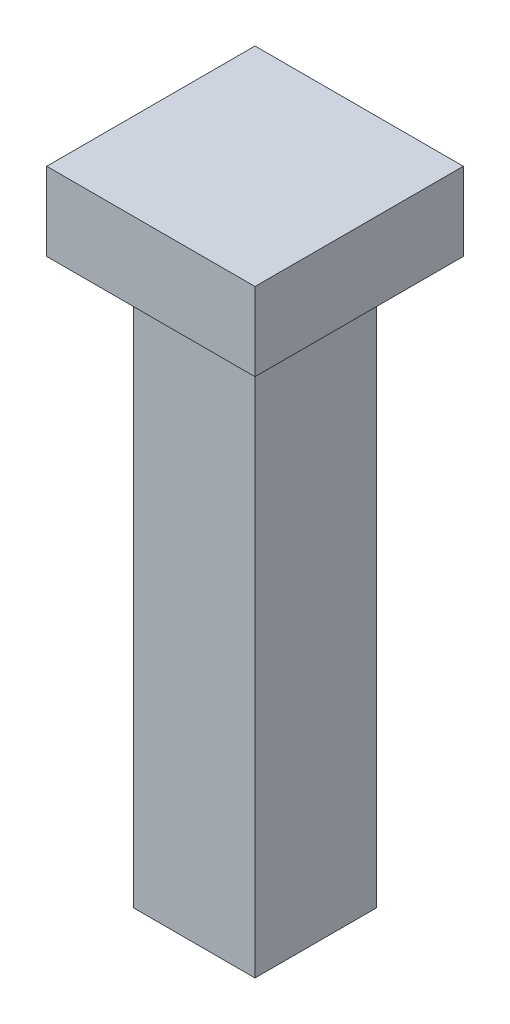
ISO-10303-21;
HEADER;
FILE_DESCRIPTION(('STEP AP214'),'2;1');
FILE_NAME('part.step','',(''),(''),'','','');
FILE_SCHEMA(('AUTOMOTIVE_DESIGN { 1 0 10303 214 1 1 1 1 }'));
ENDSEC;
DATA;
#1=APPLICATION_CONTEXT('core data for automotive mechanical design processes');
#2=APPLICATION_PROTOCOL_DEFINITION('international standard','automotive_design',2000,#1);
#3=PRODUCT_CONTEXT('',#1,'mechanical');
#4=PRODUCT('Part','Part','',(#3));
#5=PRODUCT_RELATED_PRODUCT_CATEGORY('part','',(#4));
#6=PRODUCT_DEFINITION_FORMATION('','',#4);
#7=PRODUCT_DEFINITION_CONTEXT('part definition',#1,'design');
#8=PRODUCT_DEFINITION('design','',#6,#7);
#9=PRODUCT_DEFINITION_SHAPE('','',#8);
#10=(LENGTH_UNIT() NAMED_UNIT(*) SI_UNIT(.MILLI.,.METRE.));
#11=(NAMED_UNIT(*) PLANE_ANGLE_UNIT() SI_UNIT($,.RADIAN.));
#12=(NAMED_UNIT(*) SI_UNIT($,.STERADIAN.) SOLID_ANGLE_UNIT());
#13=UNCERTAINTY_MEASURE_WITH_UNIT(LENGTH_MEASURE(1.E-05),#10,'distance_accuracy_value','');
#14=(GEOMETRIC_REPRESENTATION_CONTEXT(3) GLOBAL_UNCERTAINTY_ASSIGNED_CONTEXT((#13)) GLOBAL_UNIT_ASSIGNED_CONTEXT((#10,
#11,#12)) REPRESENTATION_CONTEXT('',''));
#15=CARTESIAN_POINT('',(0.,0.,0.));
#16=DIRECTION('',(0.,0.,1.));
#17=DIRECTION('',(1.,0.,0.));
#18=AXIS2_PLACEMENT_3D('',#15,#16,#17);
#19=CARTESIAN_POINT('',(0.,16.51,0.));
#20=DIRECTION('',(1.,0.,0.));
#21=DIRECTION('',(0.,0.,-1.));
#22=AXIS2_PLACEMENT_3D('',#19,#20,#21);
#23=PLANE('',#22);
#24=DIRECTION('',(0.,0.,1.));
#25=VECTOR('',#24,1.);
#26=CARTESIAN_POINT('',(0.,0.,0.));
#27=LINE('',#26,#25);
#28=CARTESIAN_POINT('',(0.,0.,0.));
#29=VERTEX_POINT('',#28);
#30=CARTESIAN_POINT('',(0.,0.,3.556));
#31=VERTEX_POINT('',#30);
#32=EDGE_CURVE('E131',#29,#31,#27,.T.);
#33=ORIENTED_EDGE('',*,*,#32,.T.);
#34=DIRECTION('',(0.,-1.,0.));
#35=VECTOR('',#34,1.);
#36=CARTESIAN_POINT('',(0.,16.51,3.556));
#37=LINE('',#36,#35);
#38=CARTESIAN_POINT('',(0.,16.51,3.556));
#39=VERTEX_POINT('',#38);
#40=EDGE_CURVE('E11',#39,#31,#37,.T.);
#41=ORIENTED_EDGE('',*,*,#40,.F.);
#42=DIRECTION('',(0.,0.,1.));
#43=VECTOR('',#42,1.);
#44=CARTESIAN_POINT('',(0.,16.51,0.));
#45=LINE('',#44,#43);
#46=CARTESIAN_POINT('',(0.,16.51,0.));
#47=VERTEX_POINT('',#46);
#48=EDGE_CURVE('E140',#47,#39,#45,.T.);
#49=ORIENTED_EDGE('',*,*,#48,.F.);
#50=DIRECTION('',(0.,-1.,0.));
#51=VECTOR('',#50,1.);
#52=CARTESIAN_POINT('',(0.,16.51,0.));
#53=LINE('',#52,#51);
#54=EDGE_CURVE('E149',#47,#29,#53,.T.);
#55=ORIENTED_EDGE('',*,*,#54,.T.);
#56=EDGE_LOOP('',(#33,#41,#49,#55));
#57=FACE_BOUND('',#56,.T.);
#58=ADVANCED_FACE('F33',(#57),#23,.F.);
#59=CARTESIAN_POINT('',(0.,16.51,3.556));
#60=DIRECTION('',(0.,0.,-1.));
#61=DIRECTION('',(-1.,0.,0.));
#62=AXIS2_PLACEMENT_3D('',#59,#60,#61);
#63=PLANE('',#62);
#64=DIRECTION('',(1.,0.,0.));
#65=VECTOR('',#64,1.);
#66=CARTESIAN_POINT('',(0.,0.,3.556));
#67=LINE('',#66,#65);
#68=CARTESIAN_POINT('',(3.556,0.,3.556));
#69=VERTEX_POINT('',#68);
#70=EDGE_CURVE('E134',#31,#69,#67,.T.);
#71=ORIENTED_EDGE('',*,*,#70,.T.);
#72=DIRECTION('',(0.,-1.,0.));
#73=VECTOR('',#72,1.);
#74=CARTESIAN_POINT('',(3.556,16.51,3.556));
#75=LINE('',#74,#73);
#76=CARTESIAN_POINT('',(3.556,16.51,3.556));
#77=VERTEX_POINT('',#76);
#78=EDGE_CURVE('E41',#77,#69,#75,.T.);
#79=ORIENTED_EDGE('',*,*,#78,.F.);
#80=DIRECTION('',(1.,0.,0.));
#81=VECTOR('',#80,1.);
#82=CARTESIAN_POINT('',(0.,16.51,3.556));
#83=LINE('',#82,#81);
#84=EDGE_CURVE('E75',#39,#77,#83,.T.);
#85=ORIENTED_EDGE('',*,*,#84,.F.);
#86=ORIENTED_EDGE('',*,*,#40,.T.);
#87=EDGE_LOOP('',(#71,#79,#85,#86));
#88=FACE_BOUND('',#87,.T.);
#89=ADVANCED_FACE('F175',(#88),#63,.F.);
#90=CARTESIAN_POINT('',(3.556,16.51,0.));
#91=DIRECTION('',(-1.,0.,0.));
#92=DIRECTION('',(0.,0.,1.));
#93=AXIS2_PLACEMENT_3D('',#90,#91,#92);
#94=PLANE('',#93);
#95=DIRECTION('',(0.,0.,-1.));
#96=VECTOR('',#95,1.);
#97=CARTESIAN_POINT('',(3.556,0.,0.));
#98=LINE('',#97,#96);
#99=CARTESIAN_POINT('',(3.556,0.,0.));
#100=VERTEX_POINT('',#99);
#101=EDGE_CURVE('E65',#69,#100,#98,.T.);
#102=ORIENTED_EDGE('',*,*,#101,.T.);
#103=DIRECTION('',(0.,-1.,0.));
#104=VECTOR('',#103,1.);
#105=CARTESIAN_POINT('',(3.556,16.51,0.));
#106=LINE('',#105,#104);
#107=CARTESIAN_POINT('',(3.556,16.51,0.));
#108=VERTEX_POINT('',#107);
#109=EDGE_CURVE('E49',#108,#100,#106,.T.);
#110=ORIENTED_EDGE('',*,*,#109,.F.);
#111=DIRECTION('',(0.,0.,-1.));
#112=VECTOR('',#111,1.);
#113=CARTESIAN_POINT('',(3.556,16.51,0.));
#114=LINE('',#113,#112);
#115=EDGE_CURVE('E144',#77,#108,#114,.T.);
#116=ORIENTED_EDGE('',*,*,#115,.F.);
#117=ORIENTED_EDGE('',*,*,#78,.T.);
#118=EDGE_LOOP('',(#102,#110,#116,#117));
#119=FACE_BOUND('',#118,.T.);
#120=ADVANCED_FACE('F155',(#119),#94,.F.);
#121=CARTESIAN_POINT('',(0.,16.51,0.));
#122=DIRECTION('',(0.,0.,1.));
#123=DIRECTION('',(1.,0.,0.));
#124=AXIS2_PLACEMENT_3D('',#121,#122,#123);
#125=PLANE('',#124);
#126=DIRECTION('',(-1.,0.,0.));
#127=VECTOR('',#126,1.);
#128=CARTESIAN_POINT('',(0.,0.,0.));
#129=LINE('',#128,#127);
#130=EDGE_CURVE('E70',#100,#29,#129,.T.);
#131=ORIENTED_EDGE('',*,*,#130,.T.);
#132=ORIENTED_EDGE('',*,*,#54,.F.);
#133=DIRECTION('',(-1.,0.,0.));
#134=VECTOR('',#133,1.);
#135=CARTESIAN_POINT('',(0.,16.51,0.));
#136=LINE('',#135,#134);
#137=EDGE_CURVE('E147',#108,#47,#136,.T.);
#138=ORIENTED_EDGE('',*,*,#137,.F.);
#139=ORIENTED_EDGE('',*,*,#109,.T.);
#140=EDGE_LOOP('',(#131,#132,#138,#139));
#141=FACE_BOUND('',#140,.T.);
#142=ADVANCED_FACE('F160',(#141),#125,.F.);
#143=CARTESIAN_POINT('',(0.,0.,0.));
#144=DIRECTION('',(0.,1.,0.));
#145=DIRECTION('',(0.,0.,1.));
#146=AXIS2_PLACEMENT_3D('',#143,#144,#145);
#147=PLANE('',#146);
#148=ORIENTED_EDGE('',*,*,#32,.F.);
#149=ORIENTED_EDGE('',*,*,#130,.F.);
#150=ORIENTED_EDGE('',*,*,#101,.F.);
#151=ORIENTED_EDGE('',*,*,#70,.F.);
#152=EDGE_LOOP('',(#148,#149,#150,#151));
#153=FACE_BOUND('',#152,.T.);
#154=ADVANCED_FACE('F158',(#153),#147,.F.);
#155=CARTESIAN_POINT('',(0.,16.51,0.));
#156=DIRECTION('',(0.,1.,0.));
#157=DIRECTION('',(0.,0.,1.));
#158=AXIS2_PLACEMENT_3D('',#155,#156,#157);
#159=PLANE('',#158);
#160=DIRECTION('',(-1.,0.,0.));
#161=VECTOR('',#160,1.);
#162=CARTESIAN_POINT('',(4.826,16.51,-1.27));
#163=LINE('',#162,#161);
#164=CARTESIAN_POINT('',(4.826,16.51,-1.27));
#165=VERTEX_POINT('',#164);
#166=CARTESIAN_POINT('',(-1.27,16.51,-1.27));
#167=VERTEX_POINT('',#166);
#168=EDGE_CURVE('E130',#165,#167,#163,.T.);
#169=ORIENTED_EDGE('',*,*,#168,.F.);
#170=DIRECTION('',(0.,0.,-1.));
#171=VECTOR('',#170,1.);
#172=CARTESIAN_POINT('',(4.826,16.51,4.826));
#173=LINE('',#172,#171);
#174=CARTESIAN_POINT('',(4.826,16.51,4.826));
#175=VERTEX_POINT('',#174);
#176=EDGE_CURVE('E126',#175,#165,#173,.T.);
#177=ORIENTED_EDGE('',*,*,#176,.F.);
#178=DIRECTION('',(1.,0.,0.));
#179=VECTOR('',#178,1.);
#180=CARTESIAN_POINT('',(-1.27,16.51,4.826));
#181=LINE('',#180,#179);
#182=CARTESIAN_POINT('',(-1.27,16.51,4.826));
#183=VERTEX_POINT('',#182);
#184=EDGE_CURVE('E202',#183,#175,#181,.T.);
#185=ORIENTED_EDGE('',*,*,#184,.F.);
#186=DIRECTION('',(0.,0.,1.));
#187=VECTOR('',#186,1.);
#188=CARTESIAN_POINT('',(-1.27,16.51,-1.27));
#189=LINE('',#188,#187);
#190=EDGE_CURVE('E205',#167,#183,#189,.T.);
#191=ORIENTED_EDGE('',*,*,#190,.F.);
#192=EDGE_LOOP('',(#169,#177,#185,#191));
#193=FACE_BOUND('',#192,.T.);
#194=ORIENTED_EDGE('',*,*,#137,.T.);
#195=ORIENTED_EDGE('',*,*,#48,.T.);
#196=ORIENTED_EDGE('',*,*,#84,.T.);
#197=ORIENTED_EDGE('',*,*,#115,.T.);
#198=EDGE_LOOP('',(#194,#195,#196,#197));
#199=FACE_BOUND('',#198,.T.);
#200=ADVANCED_FACE('F162',(#193,#199),#159,.F.);
#201=CARTESIAN_POINT('',(4.826,18.796,-1.27));
#202=DIRECTION('',(0.,0.,1.));
#203=DIRECTION('',(1.,0.,0.));
#204=AXIS2_PLACEMENT_3D('',#201,#202,#203);
#205=PLANE('',#204);
#206=ORIENTED_EDGE('',*,*,#168,.T.);
#207=DIRECTION('',(0.,-1.,0.));
#208=VECTOR('',#207,1.);
#209=CARTESIAN_POINT('',(-1.27,18.796,-1.27));
#210=LINE('',#209,#208);
#211=CARTESIAN_POINT('',(-1.27,18.796,-1.27));
#212=VERTEX_POINT('',#211);
#213=EDGE_CURVE('E110',#212,#167,#210,.T.);
#214=ORIENTED_EDGE('',*,*,#213,.F.);
#215=DIRECTION('',(-1.,0.,0.));
#216=VECTOR('',#215,1.);
#217=CARTESIAN_POINT('',(4.826,18.796,-1.27));
#218=LINE('',#217,#216);
#219=CARTESIAN_POINT('',(4.826,18.796,-1.27));
#220=VERTEX_POINT('',#219);
#221=EDGE_CURVE('E117',#220,#212,#218,.T.);
#222=ORIENTED_EDGE('',*,*,#221,.F.);
#223=DIRECTION('',(0.,-1.,0.));
#224=VECTOR('',#223,1.);
#225=CARTESIAN_POINT('',(4.826,18.796,-1.27));
#226=LINE('',#225,#224);
#227=EDGE_CURVE('E199',#220,#165,#226,.T.);
#228=ORIENTED_EDGE('',*,*,#227,.T.);
#229=EDGE_LOOP('',(#206,#214,#222,#228));
#230=FACE_BOUND('',#229,.T.);
#231=ADVANCED_FACE('F128',(#230),#205,.F.);
#232=CARTESIAN_POINT('',(-1.27,18.796,-1.27));
#233=DIRECTION('',(1.,0.,0.));
#234=DIRECTION('',(0.,0.,-1.));
#235=AXIS2_PLACEMENT_3D('',#232,#233,#234);
#236=PLANE('',#235);
#237=ORIENTED_EDGE('',*,*,#190,.T.);
#238=DIRECTION('',(0.,-1.,0.));
#239=VECTOR('',#238,1.);
#240=CARTESIAN_POINT('',(-1.27,18.796,4.826));
#241=LINE('',#240,#239);
#242=CARTESIAN_POINT('',(-1.27,18.796,4.826));
#243=VERTEX_POINT('',#242);
#244=EDGE_CURVE('E113',#243,#183,#241,.T.);
#245=ORIENTED_EDGE('',*,*,#244,.F.);
#246=DIRECTION('',(0.,0.,1.));
#247=VECTOR('',#246,1.);
#248=CARTESIAN_POINT('',(-1.27,18.796,-1.27));
#249=LINE('',#248,#247);
#250=EDGE_CURVE('E106',#212,#243,#249,.T.);
#251=ORIENTED_EDGE('',*,*,#250,.F.);
#252=ORIENTED_EDGE('',*,*,#213,.T.);
#253=EDGE_LOOP('',(#237,#245,#251,#252));
#254=FACE_BOUND('',#253,.T.);
#255=ADVANCED_FACE('F108',(#254),#236,.F.);
#256=CARTESIAN_POINT('',(-1.27,18.796,4.826));
#257=DIRECTION('',(0.,0.,-1.));
#258=DIRECTION('',(-1.,0.,0.));
#259=AXIS2_PLACEMENT_3D('',#256,#257,#258);
#260=PLANE('',#259);
#261=ORIENTED_EDGE('',*,*,#184,.T.);
#262=DIRECTION('',(0.,-1.,0.));
#263=VECTOR('',#262,1.);
#264=CARTESIAN_POINT('',(4.826,18.796,4.826));
#265=LINE('',#264,#263);
#266=CARTESIAN_POINT('',(4.826,18.796,4.826));
#267=VERTEX_POINT('',#266);
#268=EDGE_CURVE('E136',#267,#175,#265,.T.);
#269=ORIENTED_EDGE('',*,*,#268,.F.);
#270=DIRECTION('',(1.,0.,0.));
#271=VECTOR('',#270,1.);
#272=CARTESIAN_POINT('',(-1.27,18.796,4.826));
#273=LINE('',#272,#271);
#274=EDGE_CURVE('E116',#243,#267,#273,.T.);
#275=ORIENTED_EDGE('',*,*,#274,.F.);
#276=ORIENTED_EDGE('',*,*,#244,.T.);
#277=EDGE_LOOP('',(#261,#269,#275,#276));
#278=FACE_BOUND('',#277,.T.);
#279=ADVANCED_FACE('F188',(#278),#260,.F.);
#280=CARTESIAN_POINT('',(4.826,18.796,4.826));
#281=DIRECTION('',(-1.,0.,0.));
#282=DIRECTION('',(0.,0.,1.));
#283=AXIS2_PLACEMENT_3D('',#280,#281,#282);
#284=PLANE('',#283);
#285=ORIENTED_EDGE('',*,*,#176,.T.);
#286=ORIENTED_EDGE('',*,*,#227,.F.);
#287=DIRECTION('',(0.,0.,-1.));
#288=VECTOR('',#287,1.);
#289=CARTESIAN_POINT('',(4.826,18.796,4.826));
#290=LINE('',#289,#288);
#291=EDGE_CURVE('E122',#267,#220,#290,.T.);
#292=ORIENTED_EDGE('',*,*,#291,.F.);
#293=ORIENTED_EDGE('',*,*,#268,.T.);
#294=EDGE_LOOP('',(#285,#286,#292,#293));
#295=FACE_BOUND('',#294,.T.);
#296=ADVANCED_FACE('F190',(#295),#284,.F.);
#297=CARTESIAN_POINT('',(0.,18.796,0.));
#298=DIRECTION('',(0.,1.,0.));
#299=DIRECTION('',(0.,0.,1.));
#300=AXIS2_PLACEMENT_3D('',#297,#298,#299);
#301=PLANE('',#300);
#302=ORIENTED_EDGE('',*,*,#221,.T.);
#303=ORIENTED_EDGE('',*,*,#250,.T.);
#304=ORIENTED_EDGE('',*,*,#274,.T.);
#305=ORIENTED_EDGE('',*,*,#291,.T.);
#306=EDGE_LOOP('',(#302,#303,#304,#305));
#307=FACE_BOUND('',#306,.T.);
#308=ADVANCED_FACE('F120',(#307),#301,.T.);
#309=CLOSED_SHELL('',(#58,#89,#120,#142,#154,#200,#231,#255,#279,#296,#308));
#310=MANIFOLD_SOLID_BREP('B2',#309);
#311=ADVANCED_BREP_SHAPE_REPRESENTATION('',(#18,#310),#14);
#312=SHAPE_DEFINITION_REPRESENTATION(#9,#311);
ENDSEC;
END-ISO-10303-21;
